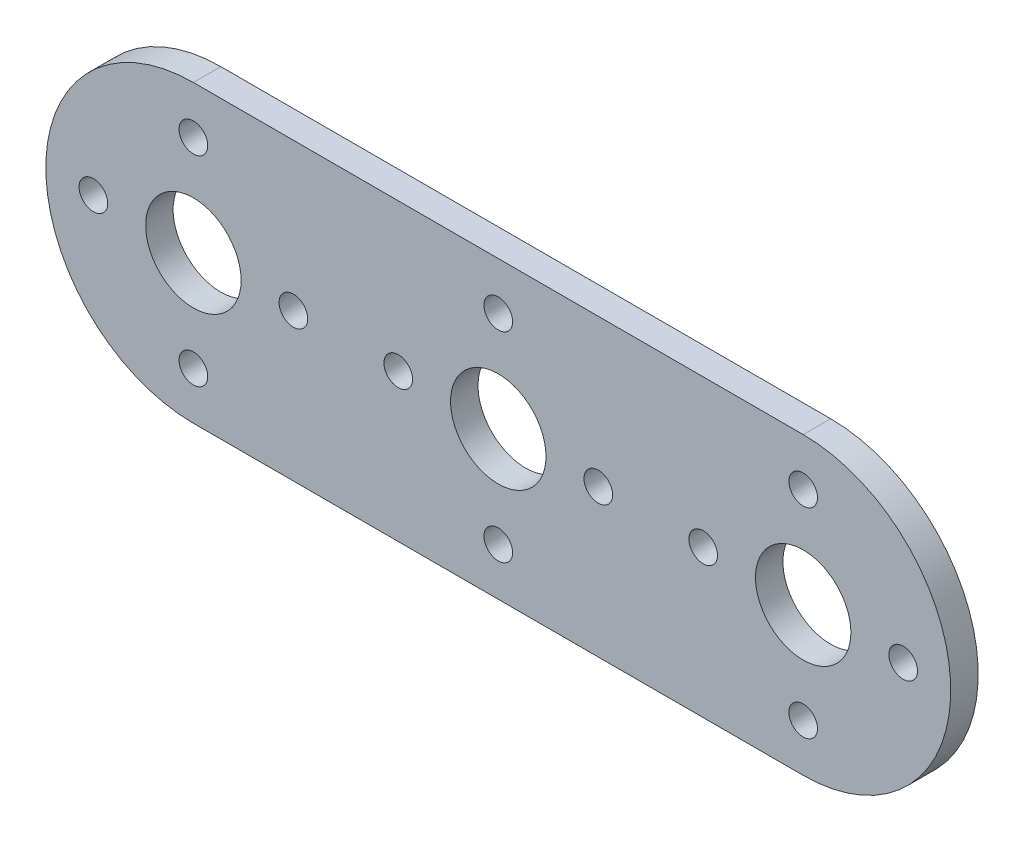
ISO-10303-21;
HEADER;
FILE_DESCRIPTION(('STEP AP214'),'2;1');
FILE_NAME('part.step','',(''),(''),'','','');
FILE_SCHEMA(('AUTOMOTIVE_DESIGN { 1 0 10303 214 1 1 1 1 }'));
ENDSEC;
DATA;
#1=APPLICATION_CONTEXT('core data for automotive mechanical design processes');
#2=APPLICATION_PROTOCOL_DEFINITION('international standard','automotive_design',2000,#1);
#3=PRODUCT_CONTEXT('',#1,'mechanical');
#4=PRODUCT('Part','Part','',(#3));
#5=PRODUCT_RELATED_PRODUCT_CATEGORY('part','',(#4));
#6=PRODUCT_DEFINITION_FORMATION('','',#4);
#7=PRODUCT_DEFINITION_CONTEXT('part definition',#1,'design');
#8=PRODUCT_DEFINITION('design','',#6,#7);
#9=PRODUCT_DEFINITION_SHAPE('','',#8);
#10=(LENGTH_UNIT() NAMED_UNIT(*) SI_UNIT(.MILLI.,.METRE.));
#11=(NAMED_UNIT(*) PLANE_ANGLE_UNIT() SI_UNIT($,.RADIAN.));
#12=(NAMED_UNIT(*) SI_UNIT($,.STERADIAN.) SOLID_ANGLE_UNIT());
#13=UNCERTAINTY_MEASURE_WITH_UNIT(LENGTH_MEASURE(1.E-05),#10,'distance_accuracy_value','');
#14=(GEOMETRIC_REPRESENTATION_CONTEXT(3) GLOBAL_UNCERTAINTY_ASSIGNED_CONTEXT((#13)) GLOBAL_UNIT_ASSIGNED_CONTEXT((#10,
#11,#12)) REPRESENTATION_CONTEXT('',''));
#15=CARTESIAN_POINT('',(0.,0.,0.));
#16=DIRECTION('',(0.,0.,1.));
#17=DIRECTION('',(1.,0.,0.));
#18=AXIS2_PLACEMENT_3D('',#15,#16,#17);
#19=CARTESIAN_POINT('',(0.,0.,2.286));
#20=DIRECTION('',(0.,0.,1.));
#21=DIRECTION('',(1.,0.,0.));
#22=AXIS2_PLACEMENT_3D('',#19,#20,#21);
#23=PLANE('',#22);
#24=CARTESIAN_POINT('',(50.7999999999999,-8.3312,2.286));
#25=DIRECTION('',(0.,0.,1.));
#26=DIRECTION('',(1.,0.,0.));
#27=AXIS2_PLACEMENT_3D('',#24,#25,#26);
#28=CIRCLE('',#27,1.19380000000001);
#29=CARTESIAN_POINT('',(51.9938,-8.3312,2.286));
#30=VERTEX_POINT('',#29);
#31=EDGE_CURVE('E226',#30,#30,#28,.T.);
#32=ORIENTED_EDGE('',*,*,#31,.F.);
#33=EDGE_LOOP('',(#32));
#34=FACE_BOUND('',#33,.T.);
#35=CARTESIAN_POINT('',(50.8,8.3312,2.286));
#36=DIRECTION('',(0.,0.,1.));
#37=DIRECTION('',(1.,0.,0.));
#38=AXIS2_PLACEMENT_3D('',#35,#36,#37);
#39=CIRCLE('',#38,1.1938);
#40=CARTESIAN_POINT('',(51.9938,8.3312,2.286));
#41=VERTEX_POINT('',#40);
#42=EDGE_CURVE('E211',#41,#41,#39,.T.);
#43=ORIENTED_EDGE('',*,*,#42,.F.);
#44=EDGE_LOOP('',(#43));
#45=FACE_BOUND('',#44,.T.);
#46=CARTESIAN_POINT('',(17.0688,0.,2.286));
#47=DIRECTION('',(0.,0.,1.));
#48=DIRECTION('',(1.,0.,0.));
#49=AXIS2_PLACEMENT_3D('',#46,#47,#48);
#50=CIRCLE('',#49,1.1938);
#51=CARTESIAN_POINT('',(18.2626,0.,2.286));
#52=VERTEX_POINT('',#51);
#53=EDGE_CURVE('E195',#52,#52,#50,.T.);
#54=ORIENTED_EDGE('',*,*,#53,.F.);
#55=EDGE_LOOP('',(#54));
#56=FACE_BOUND('',#55,.T.);
#57=CARTESIAN_POINT('',(33.7312,0.,2.286));
#58=DIRECTION('',(0.,0.,1.));
#59=DIRECTION('',(1.,0.,0.));
#60=AXIS2_PLACEMENT_3D('',#57,#58,#59);
#61=CIRCLE('',#60,1.1938);
#62=CARTESIAN_POINT('',(34.925,0.,2.286));
#63=VERTEX_POINT('',#62);
#64=EDGE_CURVE('E179',#63,#63,#61,.T.);
#65=ORIENTED_EDGE('',*,*,#64,.F.);
#66=EDGE_LOOP('',(#65));
#67=FACE_BOUND('',#66,.T.);
#68=CARTESIAN_POINT('',(-8.3312,0.,2.286));
#69=DIRECTION('',(0.,0.,1.));
#70=DIRECTION('',(1.,0.,0.));
#71=AXIS2_PLACEMENT_3D('',#68,#69,#70);
#72=CIRCLE('',#71,1.1938);
#73=CARTESIAN_POINT('',(-7.1374,0.,2.286));
#74=VERTEX_POINT('',#73);
#75=EDGE_CURVE('E164',#74,#74,#72,.T.);
#76=ORIENTED_EDGE('',*,*,#75,.F.);
#77=EDGE_LOOP('',(#76));
#78=FACE_BOUND('',#77,.T.);
#79=CARTESIAN_POINT('',(8.3312,0.,2.286));
#80=DIRECTION('',(0.,0.,1.));
#81=DIRECTION('',(1.,0.,0.));
#82=AXIS2_PLACEMENT_3D('',#79,#80,#81);
#83=CIRCLE('',#82,1.1938);
#84=CARTESIAN_POINT('',(9.525,0.,2.286));
#85=VERTEX_POINT('',#84);
#86=EDGE_CURVE('E150',#85,#85,#83,.T.);
#87=ORIENTED_EDGE('',*,*,#86,.F.);
#88=EDGE_LOOP('',(#87));
#89=FACE_BOUND('',#88,.T.);
#90=CARTESIAN_POINT('',(0.,8.3312,2.286));
#91=DIRECTION('',(0.,0.,1.));
#92=DIRECTION('',(1.,0.,0.));
#93=AXIS2_PLACEMENT_3D('',#90,#91,#92);
#94=CIRCLE('',#93,1.1938);
#95=CARTESIAN_POINT('',(1.1938,8.3312,2.286));
#96=VERTEX_POINT('',#95);
#97=EDGE_CURVE('E134',#96,#96,#94,.T.);
#98=ORIENTED_EDGE('',*,*,#97,.F.);
#99=EDGE_LOOP('',(#98));
#100=FACE_BOUND('',#99,.T.);
#101=CARTESIAN_POINT('',(0.,0.,2.286));
#102=DIRECTION('',(0.,0.,1.));
#103=DIRECTION('',(1.,0.,0.));
#104=AXIS2_PLACEMENT_3D('',#101,#102,#103);
#105=CIRCLE('',#104,12.2936);
#106=CARTESIAN_POINT('',(0.,12.2936,2.286));
#107=VERTEX_POINT('',#106);
#108=CARTESIAN_POINT('',(0.,-12.2936,2.286));
#109=VERTEX_POINT('',#108);
#110=EDGE_CURVE('E87',#107,#109,#105,.T.);
#111=ORIENTED_EDGE('',*,*,#110,.T.);
#112=DIRECTION('',(1.,0.,0.));
#113=VECTOR('',#112,1.);
#114=CARTESIAN_POINT('',(0.,-12.2936,2.286));
#115=LINE('',#114,#113);
#116=CARTESIAN_POINT('',(50.8,-12.2936,2.286));
#117=VERTEX_POINT('',#116);
#118=EDGE_CURVE('E82',#109,#117,#115,.T.);
#119=ORIENTED_EDGE('',*,*,#118,.T.);
#120=CARTESIAN_POINT('',(50.8,0.,2.286));
#121=DIRECTION('',(0.,0.,1.));
#122=DIRECTION('',(1.,0.,0.));
#123=AXIS2_PLACEMENT_3D('',#120,#121,#122);
#124=CIRCLE('',#123,12.2936);
#125=CARTESIAN_POINT('',(50.8,12.2936,2.286));
#126=VERTEX_POINT('',#125);
#127=EDGE_CURVE('E85',#117,#126,#124,.T.);
#128=ORIENTED_EDGE('',*,*,#127,.T.);
#129=DIRECTION('',(-1.,0.,0.));
#130=VECTOR('',#129,1.);
#131=CARTESIAN_POINT('',(0.,12.2936,2.286));
#132=LINE('',#131,#130);
#133=EDGE_CURVE('E52',#126,#107,#132,.T.);
#134=ORIENTED_EDGE('',*,*,#133,.T.);
#135=EDGE_LOOP('',(#111,#119,#128,#134));
#136=FACE_BOUND('',#135,.T.);
#137=CARTESIAN_POINT('',(0.,0.,2.286));
#138=DIRECTION('',(0.,0.,1.));
#139=DIRECTION('',(1.,0.,0.));
#140=AXIS2_PLACEMENT_3D('',#137,#138,#139);
#141=CIRCLE('',#140,3.9751);
#142=CARTESIAN_POINT('',(3.9751,0.,2.286));
#143=VERTEX_POINT('',#142);
#144=EDGE_CURVE('E109',#143,#143,#141,.T.);
#145=ORIENTED_EDGE('',*,*,#144,.F.);
#146=EDGE_LOOP('',(#145));
#147=FACE_BOUND('',#146,.T.);
#148=CARTESIAN_POINT('',(25.4,0.,2.286));
#149=DIRECTION('',(0.,0.,1.));
#150=DIRECTION('',(1.,0.,0.));
#151=AXIS2_PLACEMENT_3D('',#148,#149,#150);
#152=CIRCLE('',#151,3.9751);
#153=CARTESIAN_POINT('',(29.3751,0.,2.286));
#154=VERTEX_POINT('',#153);
#155=EDGE_CURVE('E142',#154,#154,#152,.T.);
#156=ORIENTED_EDGE('',*,*,#155,.F.);
#157=EDGE_LOOP('',(#156));
#158=FACE_BOUND('',#157,.T.);
#159=CARTESIAN_POINT('',(0.,-8.3312,2.286));
#160=DIRECTION('',(0.,0.,1.));
#161=DIRECTION('',(1.,0.,0.));
#162=AXIS2_PLACEMENT_3D('',#159,#160,#161);
#163=CIRCLE('',#162,1.1938);
#164=CARTESIAN_POINT('',(1.19379999999994,-8.3312,2.286));
#165=VERTEX_POINT('',#164);
#166=EDGE_CURVE('E157',#165,#165,#163,.T.);
#167=ORIENTED_EDGE('',*,*,#166,.F.);
#168=EDGE_LOOP('',(#167));
#169=FACE_BOUND('',#168,.T.);
#170=CARTESIAN_POINT('',(25.4,8.3312,2.286));
#171=DIRECTION('',(0.,0.,1.));
#172=DIRECTION('',(1.,0.,0.));
#173=AXIS2_PLACEMENT_3D('',#170,#171,#172);
#174=CIRCLE('',#173,1.1938);
#175=CARTESIAN_POINT('',(26.5938,8.3312,2.286));
#176=VERTEX_POINT('',#175);
#177=EDGE_CURVE('E171',#176,#176,#174,.T.);
#178=ORIENTED_EDGE('',*,*,#177,.F.);
#179=EDGE_LOOP('',(#178));
#180=FACE_BOUND('',#179,.T.);
#181=CARTESIAN_POINT('',(25.3999999999999,-8.3312,2.286));
#182=DIRECTION('',(0.,0.,1.));
#183=DIRECTION('',(1.,0.,0.));
#184=AXIS2_PLACEMENT_3D('',#181,#182,#183);
#185=CIRCLE('',#184,1.1938);
#186=CARTESIAN_POINT('',(26.5937999999999,-8.3312,2.286));
#187=VERTEX_POINT('',#186);
#188=EDGE_CURVE('E187',#187,#187,#185,.T.);
#189=ORIENTED_EDGE('',*,*,#188,.F.);
#190=EDGE_LOOP('',(#189));
#191=FACE_BOUND('',#190,.T.);
#192=CARTESIAN_POINT('',(50.8,0.,2.286));
#193=DIRECTION('',(0.,0.,1.));
#194=DIRECTION('',(1.,0.,0.));
#195=AXIS2_PLACEMENT_3D('',#192,#193,#194);
#196=CIRCLE('',#195,3.9751);
#197=CARTESIAN_POINT('',(54.7751,0.,2.286));
#198=VERTEX_POINT('',#197);
#199=EDGE_CURVE('E203',#198,#198,#196,.T.);
#200=ORIENTED_EDGE('',*,*,#199,.F.);
#201=EDGE_LOOP('',(#200));
#202=FACE_BOUND('',#201,.T.);
#203=CARTESIAN_POINT('',(59.1312,0.,2.286));
#204=DIRECTION('',(0.,0.,1.));
#205=DIRECTION('',(1.,0.,0.));
#206=AXIS2_PLACEMENT_3D('',#203,#204,#205);
#207=CIRCLE('',#206,1.1938);
#208=CARTESIAN_POINT('',(60.325,0.,2.286));
#209=VERTEX_POINT('',#208);
#210=EDGE_CURVE('E219',#209,#209,#207,.T.);
#211=ORIENTED_EDGE('',*,*,#210,.F.);
#212=EDGE_LOOP('',(#211));
#213=FACE_BOUND('',#212,.T.);
#214=CARTESIAN_POINT('',(42.4688,0.,2.286));
#215=DIRECTION('',(0.,0.,1.));
#216=DIRECTION('',(1.,0.,0.));
#217=AXIS2_PLACEMENT_3D('',#214,#215,#216);
#218=CIRCLE('',#217,1.1938);
#219=CARTESIAN_POINT('',(43.6626,0.,2.286));
#220=VERTEX_POINT('',#219);
#221=EDGE_CURVE('E233',#220,#220,#218,.T.);
#222=ORIENTED_EDGE('',*,*,#221,.F.);
#223=EDGE_LOOP('',(#222));
#224=FACE_BOUND('',#223,.T.);
#225=ADVANCED_FACE('F34',(#34,#45,#56,#67,#78,#89,#100,#136,#147,#158,#169,#180,#191,#202,#213,
#224),#23,.T.);
#226=CARTESIAN_POINT('',(0.,0.,0.));
#227=DIRECTION('',(0.,0.,1.));
#228=DIRECTION('',(1.,0.,0.));
#229=AXIS2_PLACEMENT_3D('',#226,#227,#228);
#230=PLANE('',#229);
#231=CARTESIAN_POINT('',(50.7999999999999,-8.3312,0.));
#232=DIRECTION('',(0.,0.,1.));
#233=DIRECTION('',(1.,0.,0.));
#234=AXIS2_PLACEMENT_3D('',#231,#232,#233);
#235=CIRCLE('',#234,1.19380000000001);
#236=CARTESIAN_POINT('',(51.9938,-8.3312,0.));
#237=VERTEX_POINT('',#236);
#238=EDGE_CURVE('E229',#237,#237,#235,.T.);
#239=ORIENTED_EDGE('',*,*,#238,.T.);
#240=EDGE_LOOP('',(#239));
#241=FACE_BOUND('',#240,.T.);
#242=CARTESIAN_POINT('',(50.8,8.3312,0.));
#243=DIRECTION('',(0.,0.,1.));
#244=DIRECTION('',(1.,0.,0.));
#245=AXIS2_PLACEMENT_3D('',#242,#243,#244);
#246=CIRCLE('',#245,1.1938);
#247=CARTESIAN_POINT('',(51.9938,8.3312,0.));
#248=VERTEX_POINT('',#247);
#249=EDGE_CURVE('E215',#248,#248,#246,.T.);
#250=ORIENTED_EDGE('',*,*,#249,.T.);
#251=EDGE_LOOP('',(#250));
#252=FACE_BOUND('',#251,.T.);
#253=CARTESIAN_POINT('',(17.0688,0.,0.));
#254=DIRECTION('',(0.,0.,1.));
#255=DIRECTION('',(1.,0.,0.));
#256=AXIS2_PLACEMENT_3D('',#253,#254,#255);
#257=CIRCLE('',#256,1.1938);
#258=CARTESIAN_POINT('',(18.2626,0.,0.));
#259=VERTEX_POINT('',#258);
#260=EDGE_CURVE('E199',#259,#259,#257,.T.);
#261=ORIENTED_EDGE('',*,*,#260,.T.);
#262=EDGE_LOOP('',(#261));
#263=FACE_BOUND('',#262,.T.);
#264=CARTESIAN_POINT('',(33.7312,0.,0.));
#265=DIRECTION('',(0.,0.,1.));
#266=DIRECTION('',(1.,0.,0.));
#267=AXIS2_PLACEMENT_3D('',#264,#265,#266);
#268=CIRCLE('',#267,1.1938);
#269=CARTESIAN_POINT('',(34.925,0.,0.));
#270=VERTEX_POINT('',#269);
#271=EDGE_CURVE('E183',#270,#270,#268,.T.);
#272=ORIENTED_EDGE('',*,*,#271,.T.);
#273=EDGE_LOOP('',(#272));
#274=FACE_BOUND('',#273,.T.);
#275=CARTESIAN_POINT('',(-8.3312,0.,0.));
#276=DIRECTION('',(0.,0.,1.));
#277=DIRECTION('',(1.,0.,0.));
#278=AXIS2_PLACEMENT_3D('',#275,#276,#277);
#279=CIRCLE('',#278,1.1938);
#280=CARTESIAN_POINT('',(-7.1374,0.,0.));
#281=VERTEX_POINT('',#280);
#282=EDGE_CURVE('E168',#281,#281,#279,.T.);
#283=ORIENTED_EDGE('',*,*,#282,.T.);
#284=EDGE_LOOP('',(#283));
#285=FACE_BOUND('',#284,.T.);
#286=CARTESIAN_POINT('',(8.3312,0.,0.));
#287=DIRECTION('',(0.,0.,1.));
#288=DIRECTION('',(1.,0.,0.));
#289=AXIS2_PLACEMENT_3D('',#286,#287,#288);
#290=CIRCLE('',#289,1.1938);
#291=CARTESIAN_POINT('',(9.525,0.,0.));
#292=VERTEX_POINT('',#291);
#293=EDGE_CURVE('E153',#292,#292,#290,.T.);
#294=ORIENTED_EDGE('',*,*,#293,.T.);
#295=EDGE_LOOP('',(#294));
#296=FACE_BOUND('',#295,.T.);
#297=CARTESIAN_POINT('',(0.,8.3312,0.));
#298=DIRECTION('',(0.,0.,1.));
#299=DIRECTION('',(1.,0.,0.));
#300=AXIS2_PLACEMENT_3D('',#297,#298,#299);
#301=CIRCLE('',#300,1.1938);
#302=CARTESIAN_POINT('',(1.1938,8.3312,0.));
#303=VERTEX_POINT('',#302);
#304=EDGE_CURVE('E138',#303,#303,#301,.T.);
#305=ORIENTED_EDGE('',*,*,#304,.T.);
#306=EDGE_LOOP('',(#305));
#307=FACE_BOUND('',#306,.T.);
#308=CARTESIAN_POINT('',(0.,0.,0.));
#309=DIRECTION('',(0.,0.,1.));
#310=DIRECTION('',(1.,0.,0.));
#311=AXIS2_PLACEMENT_3D('',#308,#309,#310);
#312=CIRCLE('',#311,12.2936);
#313=CARTESIAN_POINT('',(0.,12.2936,0.));
#314=VERTEX_POINT('',#313);
#315=CARTESIAN_POINT('',(0.,-12.2936,0.));
#316=VERTEX_POINT('',#315);
#317=EDGE_CURVE('E105',#314,#316,#312,.T.);
#318=ORIENTED_EDGE('',*,*,#317,.F.);
#319=DIRECTION('',(-1.,0.,0.));
#320=VECTOR('',#319,1.);
#321=CARTESIAN_POINT('',(0.,12.2936,0.));
#322=LINE('',#321,#320);
#323=CARTESIAN_POINT('',(50.8,12.2936,0.));
#324=VERTEX_POINT('',#323);
#325=EDGE_CURVE('E75',#324,#314,#322,.T.);
#326=ORIENTED_EDGE('',*,*,#325,.F.);
#327=CARTESIAN_POINT('',(50.8,0.,0.));
#328=DIRECTION('',(0.,0.,1.));
#329=DIRECTION('',(1.,0.,0.));
#330=AXIS2_PLACEMENT_3D('',#327,#328,#329);
#331=CIRCLE('',#330,12.2936);
#332=CARTESIAN_POINT('',(50.8,-12.2936,0.));
#333=VERTEX_POINT('',#332);
#334=EDGE_CURVE('E69',#333,#324,#331,.T.);
#335=ORIENTED_EDGE('',*,*,#334,.F.);
#336=DIRECTION('',(1.,0.,0.));
#337=VECTOR('',#336,1.);
#338=CARTESIAN_POINT('',(0.,-12.2936,0.));
#339=LINE('',#338,#337);
#340=EDGE_CURVE('E92',#316,#333,#339,.T.);
#341=ORIENTED_EDGE('',*,*,#340,.F.);
#342=EDGE_LOOP('',(#318,#326,#335,#341));
#343=FACE_BOUND('',#342,.T.);
#344=CARTESIAN_POINT('',(0.,0.,0.));
#345=DIRECTION('',(0.,0.,1.));
#346=DIRECTION('',(1.,0.,0.));
#347=AXIS2_PLACEMENT_3D('',#344,#345,#346);
#348=CIRCLE('',#347,3.9751);
#349=CARTESIAN_POINT('',(3.9751,0.,0.));
#350=VERTEX_POINT('',#349);
#351=EDGE_CURVE('E130',#350,#350,#348,.T.);
#352=ORIENTED_EDGE('',*,*,#351,.T.);
#353=EDGE_LOOP('',(#352));
#354=FACE_BOUND('',#353,.T.);
#355=CARTESIAN_POINT('',(25.4,0.,0.));
#356=DIRECTION('',(0.,0.,1.));
#357=DIRECTION('',(1.,0.,0.));
#358=AXIS2_PLACEMENT_3D('',#355,#356,#357);
#359=CIRCLE('',#358,3.9751);
#360=CARTESIAN_POINT('',(29.3751,0.,0.));
#361=VERTEX_POINT('',#360);
#362=EDGE_CURVE('E146',#361,#361,#359,.T.);
#363=ORIENTED_EDGE('',*,*,#362,.T.);
#364=EDGE_LOOP('',(#363));
#365=FACE_BOUND('',#364,.T.);
#366=CARTESIAN_POINT('',(0.,-8.3312,0.));
#367=DIRECTION('',(0.,0.,1.));
#368=DIRECTION('',(1.,0.,0.));
#369=AXIS2_PLACEMENT_3D('',#366,#367,#368);
#370=CIRCLE('',#369,1.1938);
#371=CARTESIAN_POINT('',(1.19379999999994,-8.3312,0.));
#372=VERTEX_POINT('',#371);
#373=EDGE_CURVE('E161',#372,#372,#370,.T.);
#374=ORIENTED_EDGE('',*,*,#373,.T.);
#375=EDGE_LOOP('',(#374));
#376=FACE_BOUND('',#375,.T.);
#377=CARTESIAN_POINT('',(25.4,8.3312,0.));
#378=DIRECTION('',(0.,0.,1.));
#379=DIRECTION('',(1.,0.,0.));
#380=AXIS2_PLACEMENT_3D('',#377,#378,#379);
#381=CIRCLE('',#380,1.1938);
#382=CARTESIAN_POINT('',(26.5938,8.3312,0.));
#383=VERTEX_POINT('',#382);
#384=EDGE_CURVE('E175',#383,#383,#381,.T.);
#385=ORIENTED_EDGE('',*,*,#384,.T.);
#386=EDGE_LOOP('',(#385));
#387=FACE_BOUND('',#386,.T.);
#388=CARTESIAN_POINT('',(25.3999999999999,-8.3312,0.));
#389=DIRECTION('',(0.,0.,1.));
#390=DIRECTION('',(1.,0.,0.));
#391=AXIS2_PLACEMENT_3D('',#388,#389,#390);
#392=CIRCLE('',#391,1.1938);
#393=CARTESIAN_POINT('',(26.5937999999999,-8.3312,0.));
#394=VERTEX_POINT('',#393);
#395=EDGE_CURVE('E191',#394,#394,#392,.T.);
#396=ORIENTED_EDGE('',*,*,#395,.T.);
#397=EDGE_LOOP('',(#396));
#398=FACE_BOUND('',#397,.T.);
#399=CARTESIAN_POINT('',(50.8,0.,0.));
#400=DIRECTION('',(0.,0.,1.));
#401=DIRECTION('',(1.,0.,0.));
#402=AXIS2_PLACEMENT_3D('',#399,#400,#401);
#403=CIRCLE('',#402,3.9751);
#404=CARTESIAN_POINT('',(54.7751,0.,0.));
#405=VERTEX_POINT('',#404);
#406=EDGE_CURVE('E207',#405,#405,#403,.T.);
#407=ORIENTED_EDGE('',*,*,#406,.T.);
#408=EDGE_LOOP('',(#407));
#409=FACE_BOUND('',#408,.T.);
#410=CARTESIAN_POINT('',(59.1312,0.,0.));
#411=DIRECTION('',(0.,0.,1.));
#412=DIRECTION('',(1.,0.,0.));
#413=AXIS2_PLACEMENT_3D('',#410,#411,#412);
#414=CIRCLE('',#413,1.1938);
#415=CARTESIAN_POINT('',(60.325,0.,0.));
#416=VERTEX_POINT('',#415);
#417=EDGE_CURVE('E222',#416,#416,#414,.T.);
#418=ORIENTED_EDGE('',*,*,#417,.T.);
#419=EDGE_LOOP('',(#418));
#420=FACE_BOUND('',#419,.T.);
#421=CARTESIAN_POINT('',(42.4688,0.,0.));
#422=DIRECTION('',(0.,0.,1.));
#423=DIRECTION('',(1.,0.,0.));
#424=AXIS2_PLACEMENT_3D('',#421,#422,#423);
#425=CIRCLE('',#424,1.1938);
#426=CARTESIAN_POINT('',(43.6626,0.,0.));
#427=VERTEX_POINT('',#426);
#428=EDGE_CURVE('E237',#427,#427,#425,.T.);
#429=ORIENTED_EDGE('',*,*,#428,.T.);
#430=EDGE_LOOP('',(#429));
#431=FACE_BOUND('',#430,.T.);
#432=ADVANCED_FACE('F123',(#241,#252,#263,#274,#285,#296,#307,#343,#354,#365,#376,#387,#398,
#409,#420,#431),#230,.F.);
#433=CARTESIAN_POINT('',(0.,0.,2.286));
#434=DIRECTION('',(0.,0.,-1.));
#435=DIRECTION('',(-1.,0.,0.));
#436=AXIS2_PLACEMENT_3D('',#433,#434,#435);
#437=CYLINDRICAL_SURFACE('',#436,12.2936);
#438=ORIENTED_EDGE('',*,*,#317,.T.);
#439=DIRECTION('',(0.,0.,-1.));
#440=VECTOR('',#439,1.);
#441=CARTESIAN_POINT('',(0.,-12.2936,2.286));
#442=LINE('',#441,#440);
#443=EDGE_CURVE('E11',#109,#316,#442,.T.);
#444=ORIENTED_EDGE('',*,*,#443,.F.);
#445=ORIENTED_EDGE('',*,*,#110,.F.);
#446=DIRECTION('',(0.,0.,-1.));
#447=VECTOR('',#446,1.);
#448=CARTESIAN_POINT('',(0.,12.2936,2.286));
#449=LINE('',#448,#447);
#450=EDGE_CURVE('E101',#107,#314,#449,.T.);
#451=ORIENTED_EDGE('',*,*,#450,.T.);
#452=EDGE_LOOP('',(#438,#444,#445,#451));
#453=FACE_BOUND('',#452,.T.);
#454=ADVANCED_FACE('F36',(#453),#437,.T.);
#455=CARTESIAN_POINT('',(0.,-12.2936,2.286));
#456=DIRECTION('',(0.,1.,0.));
#457=DIRECTION('',(0.,0.,1.));
#458=AXIS2_PLACEMENT_3D('',#455,#456,#457);
#459=PLANE('',#458);
#460=ORIENTED_EDGE('',*,*,#340,.T.);
#461=DIRECTION('',(0.,0.,-1.));
#462=VECTOR('',#461,1.);
#463=CARTESIAN_POINT('',(50.8,-12.2936,2.286));
#464=LINE('',#463,#462);
#465=EDGE_CURVE('E44',#117,#333,#464,.T.);
#466=ORIENTED_EDGE('',*,*,#465,.F.);
#467=ORIENTED_EDGE('',*,*,#118,.F.);
#468=ORIENTED_EDGE('',*,*,#443,.T.);
#469=EDGE_LOOP('',(#460,#466,#467,#468));
#470=FACE_BOUND('',#469,.T.);
#471=ADVANCED_FACE('F91',(#470),#459,.F.);
#472=CARTESIAN_POINT('',(50.8,0.,2.286));
#473=DIRECTION('',(0.,0.,-1.));
#474=DIRECTION('',(-1.,0.,0.));
#475=AXIS2_PLACEMENT_3D('',#472,#473,#474);
#476=CYLINDRICAL_SURFACE('',#475,12.2936);
#477=ORIENTED_EDGE('',*,*,#334,.T.);
#478=DIRECTION('',(0.,0.,-1.));
#479=VECTOR('',#478,1.);
#480=CARTESIAN_POINT('',(50.8,12.2936,2.286));
#481=LINE('',#480,#479);
#482=EDGE_CURVE('E94',#126,#324,#481,.T.);
#483=ORIENTED_EDGE('',*,*,#482,.F.);
#484=ORIENTED_EDGE('',*,*,#127,.F.);
#485=ORIENTED_EDGE('',*,*,#465,.T.);
#486=EDGE_LOOP('',(#477,#483,#484,#485));
#487=FACE_BOUND('',#486,.T.);
#488=ADVANCED_FACE('F95',(#487),#476,.T.);
#489=CARTESIAN_POINT('',(0.,12.2936,2.286));
#490=DIRECTION('',(0.,-1.,0.));
#491=DIRECTION('',(0.,0.,-1.));
#492=AXIS2_PLACEMENT_3D('',#489,#490,#491);
#493=PLANE('',#492);
#494=ORIENTED_EDGE('',*,*,#325,.T.);
#495=ORIENTED_EDGE('',*,*,#450,.F.);
#496=ORIENTED_EDGE('',*,*,#133,.F.);
#497=ORIENTED_EDGE('',*,*,#482,.T.);
#498=EDGE_LOOP('',(#494,#495,#496,#497));
#499=FACE_BOUND('',#498,.T.);
#500=ADVANCED_FACE('F120',(#499),#493,.F.);
#501=CARTESIAN_POINT('',(0.,0.,2.286));
#502=DIRECTION('',(0.,0.,-1.));
#503=DIRECTION('',(-1.,0.,0.));
#504=AXIS2_PLACEMENT_3D('',#501,#502,#503);
#505=CYLINDRICAL_SURFACE('',#504,3.9751);
#506=ORIENTED_EDGE('',*,*,#144,.T.);
#507=EDGE_LOOP('',(#506));
#508=FACE_BOUND('',#507,.T.);
#509=ORIENTED_EDGE('',*,*,#351,.F.);
#510=EDGE_LOOP('',(#509));
#511=FACE_BOUND('',#510,.T.);
#512=ADVANCED_FACE('F259',(#508,#511),#505,.F.);
#513=CARTESIAN_POINT('',(0.,8.3312,2.286));
#514=DIRECTION('',(0.,0.,-1.));
#515=DIRECTION('',(-1.,0.,0.));
#516=AXIS2_PLACEMENT_3D('',#513,#514,#515);
#517=CYLINDRICAL_SURFACE('',#516,1.1938);
#518=ORIENTED_EDGE('',*,*,#97,.T.);
#519=EDGE_LOOP('',(#518));
#520=FACE_BOUND('',#519,.T.);
#521=ORIENTED_EDGE('',*,*,#304,.F.);
#522=EDGE_LOOP('',(#521));
#523=FACE_BOUND('',#522,.T.);
#524=ADVANCED_FACE('F311',(#520,#523),#517,.F.);
#525=CARTESIAN_POINT('',(25.4,0.,2.286));
#526=DIRECTION('',(0.,0.,-1.));
#527=DIRECTION('',(-1.,0.,0.));
#528=AXIS2_PLACEMENT_3D('',#525,#526,#527);
#529=CYLINDRICAL_SURFACE('',#528,3.9751);
#530=ORIENTED_EDGE('',*,*,#155,.T.);
#531=EDGE_LOOP('',(#530));
#532=FACE_BOUND('',#531,.T.);
#533=ORIENTED_EDGE('',*,*,#362,.F.);
#534=EDGE_LOOP('',(#533));
#535=FACE_BOUND('',#534,.T.);
#536=ADVANCED_FACE('F320',(#532,#535),#529,.F.);
#537=CARTESIAN_POINT('',(8.3312,0.,2.286));
#538=DIRECTION('',(0.,0.,-1.));
#539=DIRECTION('',(-1.,0.,0.));
#540=AXIS2_PLACEMENT_3D('',#537,#538,#539);
#541=CYLINDRICAL_SURFACE('',#540,1.1938);
#542=ORIENTED_EDGE('',*,*,#86,.T.);
#543=EDGE_LOOP('',(#542));
#544=FACE_BOUND('',#543,.T.);
#545=ORIENTED_EDGE('',*,*,#293,.F.);
#546=EDGE_LOOP('',(#545));
#547=FACE_BOUND('',#546,.T.);
#548=ADVANCED_FACE('F329',(#544,#547),#541,.F.);
#549=CARTESIAN_POINT('',(0.,-8.3312,2.286));
#550=DIRECTION('',(0.,0.,-1.));
#551=DIRECTION('',(-1.,0.,0.));
#552=AXIS2_PLACEMENT_3D('',#549,#550,#551);
#553=CYLINDRICAL_SURFACE('',#552,1.1938);
#554=ORIENTED_EDGE('',*,*,#166,.T.);
#555=EDGE_LOOP('',(#554));
#556=FACE_BOUND('',#555,.T.);
#557=ORIENTED_EDGE('',*,*,#373,.F.);
#558=EDGE_LOOP('',(#557));
#559=FACE_BOUND('',#558,.T.);
#560=ADVANCED_FACE('F339',(#556,#559),#553,.F.);
#561=CARTESIAN_POINT('',(-8.3312,0.,2.286));
#562=DIRECTION('',(0.,0.,-1.));
#563=DIRECTION('',(-1.,0.,0.));
#564=AXIS2_PLACEMENT_3D('',#561,#562,#563);
#565=CYLINDRICAL_SURFACE('',#564,1.1938);
#566=ORIENTED_EDGE('',*,*,#75,.T.);
#567=EDGE_LOOP('',(#566));
#568=FACE_BOUND('',#567,.T.);
#569=ORIENTED_EDGE('',*,*,#282,.F.);
#570=EDGE_LOOP('',(#569));
#571=FACE_BOUND('',#570,.T.);
#572=ADVANCED_FACE('F349',(#568,#571),#565,.F.);
#573=CARTESIAN_POINT('',(25.4,8.3312,2.286));
#574=DIRECTION('',(0.,0.,-1.));
#575=DIRECTION('',(-1.,0.,0.));
#576=AXIS2_PLACEMENT_3D('',#573,#574,#575);
#577=CYLINDRICAL_SURFACE('',#576,1.1938);
#578=ORIENTED_EDGE('',*,*,#177,.T.);
#579=EDGE_LOOP('',(#578));
#580=FACE_BOUND('',#579,.T.);
#581=ORIENTED_EDGE('',*,*,#384,.F.);
#582=EDGE_LOOP('',(#581));
#583=FACE_BOUND('',#582,.T.);
#584=ADVANCED_FACE('F359',(#580,#583),#577,.F.);
#585=CARTESIAN_POINT('',(33.7312,0.,2.286));
#586=DIRECTION('',(0.,0.,-1.));
#587=DIRECTION('',(-1.,0.,0.));
#588=AXIS2_PLACEMENT_3D('',#585,#586,#587);
#589=CYLINDRICAL_SURFACE('',#588,1.1938);
#590=ORIENTED_EDGE('',*,*,#64,.T.);
#591=EDGE_LOOP('',(#590));
#592=FACE_BOUND('',#591,.T.);
#593=ORIENTED_EDGE('',*,*,#271,.F.);
#594=EDGE_LOOP('',(#593));
#595=FACE_BOUND('',#594,.T.);
#596=ADVANCED_FACE('F369',(#592,#595),#589,.F.);
#597=CARTESIAN_POINT('',(25.3999999999999,-8.3312,2.286));
#598=DIRECTION('',(0.,0.,-1.));
#599=DIRECTION('',(-1.,0.,0.));
#600=AXIS2_PLACEMENT_3D('',#597,#598,#599);
#601=CYLINDRICAL_SURFACE('',#600,1.1938);
#602=ORIENTED_EDGE('',*,*,#188,.T.);
#603=EDGE_LOOP('',(#602));
#604=FACE_BOUND('',#603,.T.);
#605=ORIENTED_EDGE('',*,*,#395,.F.);
#606=EDGE_LOOP('',(#605));
#607=FACE_BOUND('',#606,.T.);
#608=ADVANCED_FACE('F379',(#604,#607),#601,.F.);
#609=CARTESIAN_POINT('',(17.0688,0.,2.286));
#610=DIRECTION('',(0.,0.,-1.));
#611=DIRECTION('',(-1.,0.,0.));
#612=AXIS2_PLACEMENT_3D('',#609,#610,#611);
#613=CYLINDRICAL_SURFACE('',#612,1.1938);
#614=ORIENTED_EDGE('',*,*,#53,.T.);
#615=EDGE_LOOP('',(#614));
#616=FACE_BOUND('',#615,.T.);
#617=ORIENTED_EDGE('',*,*,#260,.F.);
#618=EDGE_LOOP('',(#617));
#619=FACE_BOUND('',#618,.T.);
#620=ADVANCED_FACE('F389',(#616,#619),#613,.F.);
#621=CARTESIAN_POINT('',(50.8,0.,2.286));
#622=DIRECTION('',(0.,0.,-1.));
#623=DIRECTION('',(-1.,0.,0.));
#624=AXIS2_PLACEMENT_3D('',#621,#622,#623);
#625=CYLINDRICAL_SURFACE('',#624,3.9751);
#626=ORIENTED_EDGE('',*,*,#199,.T.);
#627=EDGE_LOOP('',(#626));
#628=FACE_BOUND('',#627,.T.);
#629=ORIENTED_EDGE('',*,*,#406,.F.);
#630=EDGE_LOOP('',(#629));
#631=FACE_BOUND('',#630,.T.);
#632=ADVANCED_FACE('F399',(#628,#631),#625,.F.);
#633=CARTESIAN_POINT('',(50.8,8.3312,2.286));
#634=DIRECTION('',(0.,0.,-1.));
#635=DIRECTION('',(-1.,0.,0.));
#636=AXIS2_PLACEMENT_3D('',#633,#634,#635);
#637=CYLINDRICAL_SURFACE('',#636,1.1938);
#638=ORIENTED_EDGE('',*,*,#42,.T.);
#639=EDGE_LOOP('',(#638));
#640=FACE_BOUND('',#639,.T.);
#641=ORIENTED_EDGE('',*,*,#249,.F.);
#642=EDGE_LOOP('',(#641));
#643=FACE_BOUND('',#642,.T.);
#644=ADVANCED_FACE('F409',(#640,#643),#637,.F.);
#645=CARTESIAN_POINT('',(59.1312,0.,2.286));
#646=DIRECTION('',(0.,0.,-1.));
#647=DIRECTION('',(-1.,0.,0.));
#648=AXIS2_PLACEMENT_3D('',#645,#646,#647);
#649=CYLINDRICAL_SURFACE('',#648,1.1938);
#650=ORIENTED_EDGE('',*,*,#210,.T.);
#651=EDGE_LOOP('',(#650));
#652=FACE_BOUND('',#651,.T.);
#653=ORIENTED_EDGE('',*,*,#417,.F.);
#654=EDGE_LOOP('',(#653));
#655=FACE_BOUND('',#654,.T.);
#656=ADVANCED_FACE('F419',(#652,#655),#649,.F.);
#657=CARTESIAN_POINT('',(50.7999999999999,-8.3312,2.286));
#658=DIRECTION('',(0.,0.,-1.));
#659=DIRECTION('',(-1.,0.,0.));
#660=AXIS2_PLACEMENT_3D('',#657,#658,#659);
#661=CYLINDRICAL_SURFACE('',#660,1.19380000000001);
#662=ORIENTED_EDGE('',*,*,#31,.T.);
#663=EDGE_LOOP('',(#662));
#664=FACE_BOUND('',#663,.T.);
#665=ORIENTED_EDGE('',*,*,#238,.F.);
#666=EDGE_LOOP('',(#665));
#667=FACE_BOUND('',#666,.T.);
#668=ADVANCED_FACE('F429',(#664,#667),#661,.F.);
#669=CARTESIAN_POINT('',(42.4688,0.,2.286));
#670=DIRECTION('',(0.,0.,-1.));
#671=DIRECTION('',(-1.,0.,0.));
#672=AXIS2_PLACEMENT_3D('',#669,#670,#671);
#673=CYLINDRICAL_SURFACE('',#672,1.1938);
#674=ORIENTED_EDGE('',*,*,#221,.T.);
#675=EDGE_LOOP('',(#674));
#676=FACE_BOUND('',#675,.T.);
#677=ORIENTED_EDGE('',*,*,#428,.F.);
#678=EDGE_LOOP('',(#677));
#679=FACE_BOUND('',#678,.T.);
#680=ADVANCED_FACE('F245',(#676,#679),#673,.F.);
#681=CLOSED_SHELL('',(#225,#432,#454,#471,#488,#500,#512,#524,#536,#548,#560,#572,#584,#596,
#608,#620,#632,#644,#656,#668,#680));
#682=MANIFOLD_SOLID_BREP('B2',#681);
#683=ADVANCED_BREP_SHAPE_REPRESENTATION('',(#18,#682),#14);
#684=SHAPE_DEFINITION_REPRESENTATION(#9,#683);
ENDSEC;
END-ISO-10303-21;
